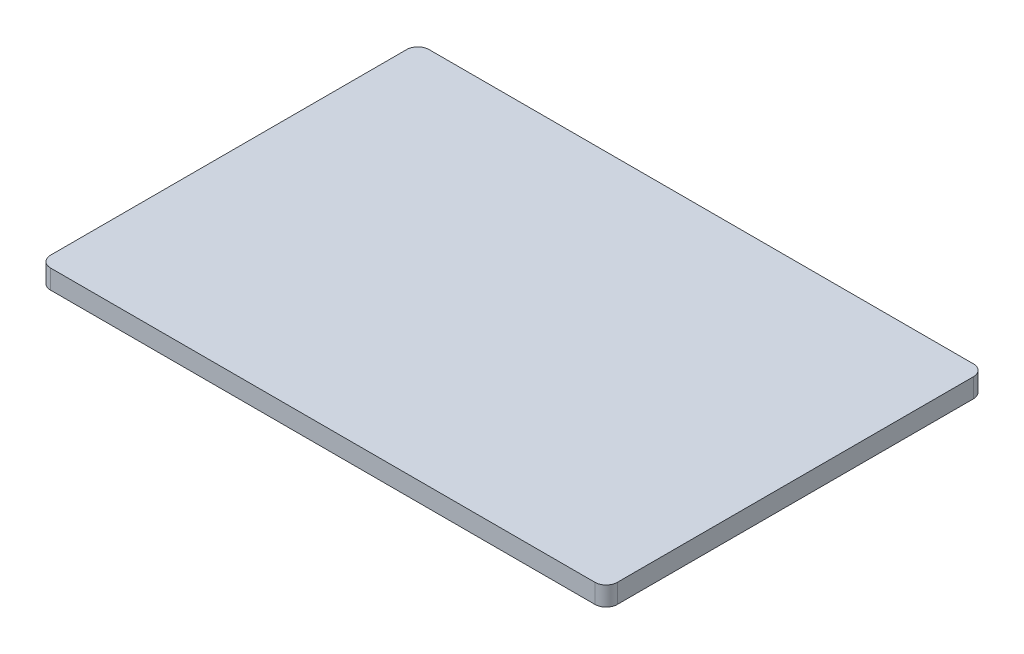
ISO-10303-21;
HEADER;
FILE_DESCRIPTION(('STEP AP214'),'2;1');
FILE_NAME('part.step','',(''),(''),'','','');
FILE_SCHEMA(('AUTOMOTIVE_DESIGN { 1 0 10303 214 1 1 1 1 }'));
ENDSEC;
DATA;
#1=APPLICATION_CONTEXT('core data for automotive mechanical design processes');
#2=APPLICATION_PROTOCOL_DEFINITION('international standard','automotive_design',2000,#1);
#3=PRODUCT_CONTEXT('',#1,'mechanical');
#4=PRODUCT('Part','Part','',(#3));
#5=PRODUCT_RELATED_PRODUCT_CATEGORY('part','',(#4));
#6=PRODUCT_DEFINITION_FORMATION('','',#4);
#7=PRODUCT_DEFINITION_CONTEXT('part definition',#1,'design');
#8=PRODUCT_DEFINITION('design','',#6,#7);
#9=PRODUCT_DEFINITION_SHAPE('','',#8);
#10=(LENGTH_UNIT() NAMED_UNIT(*) SI_UNIT(.MILLI.,.METRE.));
#11=(NAMED_UNIT(*) PLANE_ANGLE_UNIT() SI_UNIT($,.RADIAN.));
#12=(NAMED_UNIT(*) SI_UNIT($,.STERADIAN.) SOLID_ANGLE_UNIT());
#13=UNCERTAINTY_MEASURE_WITH_UNIT(LENGTH_MEASURE(1.E-05),#10,'distance_accuracy_value','');
#14=(GEOMETRIC_REPRESENTATION_CONTEXT(3) GLOBAL_UNCERTAINTY_ASSIGNED_CONTEXT((#13)) GLOBAL_UNIT_ASSIGNED_CONTEXT((#10,
#11,#12)) REPRESENTATION_CONTEXT('',''));
#15=CARTESIAN_POINT('',(0.,0.,0.));
#16=DIRECTION('',(0.,0.,1.));
#17=DIRECTION('',(1.,0.,0.));
#18=AXIS2_PLACEMENT_3D('',#15,#16,#17);
#19=CARTESIAN_POINT('',(0.,0.,0.));
#20=DIRECTION('',(0.,1.,0.));
#21=DIRECTION('',(0.,0.,1.));
#22=AXIS2_PLACEMENT_3D('',#19,#20,#21);
#23=PLANE('',#22);
#24=CARTESIAN_POINT('',(-42.5196,0.,-27.813));
#25=DIRECTION('',(0.,1.,0.));
#26=DIRECTION('',(0.,0.,1.));
#27=AXIS2_PLACEMENT_3D('',#24,#25,#26);
#28=CIRCLE('',#27,1.746);
#29=CARTESIAN_POINT('',(-42.5196,0.,-29.559));
#30=VERTEX_POINT('',#29);
#31=CARTESIAN_POINT('',(-44.2656,0.,-27.813));
#32=VERTEX_POINT('',#31);
#33=EDGE_CURVE('E116',#30,#32,#28,.T.);
#34=ORIENTED_EDGE('',*,*,#33,.F.);
#35=DIRECTION('',(-1.,0.,0.));
#36=VECTOR('',#35,1.);
#37=CARTESIAN_POINT('',(0.,0.,-29.559));
#38=LINE('',#37,#36);
#39=CARTESIAN_POINT('',(42.5196,0.,-29.559));
#40=VERTEX_POINT('',#39);
#41=EDGE_CURVE('E108',#40,#30,#38,.T.);
#42=ORIENTED_EDGE('',*,*,#41,.F.);
#43=CARTESIAN_POINT('',(42.5196,0.,-27.813));
#44=DIRECTION('',(0.,1.,0.));
#45=DIRECTION('',(0.,0.,1.));
#46=AXIS2_PLACEMENT_3D('',#43,#44,#45);
#47=CIRCLE('',#46,1.74600000000002);
#48=CARTESIAN_POINT('',(44.2656,0.,-27.813));
#49=VERTEX_POINT('',#48);
#50=EDGE_CURVE('E115',#49,#40,#47,.T.);
#51=ORIENTED_EDGE('',*,*,#50,.F.);
#52=DIRECTION('',(0.,0.,-1.));
#53=VECTOR('',#52,1.);
#54=CARTESIAN_POINT('',(44.2656,0.,0.));
#55=LINE('',#54,#53);
#56=CARTESIAN_POINT('',(44.2656,0.,27.813));
#57=VERTEX_POINT('',#56);
#58=EDGE_CURVE('E134',#57,#49,#55,.T.);
#59=ORIENTED_EDGE('',*,*,#58,.F.);
#60=CARTESIAN_POINT('',(42.5196,0.,27.813));
#61=DIRECTION('',(0.,1.,0.));
#62=DIRECTION('',(0.,0.,1.));
#63=AXIS2_PLACEMENT_3D('',#60,#61,#62);
#64=CIRCLE('',#63,1.746);
#65=CARTESIAN_POINT('',(42.5196,0.,29.559));
#66=VERTEX_POINT('',#65);
#67=EDGE_CURVE('E137',#66,#57,#64,.T.);
#68=ORIENTED_EDGE('',*,*,#67,.F.);
#69=DIRECTION('',(1.,0.,0.));
#70=VECTOR('',#69,1.);
#71=CARTESIAN_POINT('',(0.,0.,29.559));
#72=LINE('',#71,#70);
#73=CARTESIAN_POINT('',(-42.5196,0.,29.559));
#74=VERTEX_POINT('',#73);
#75=EDGE_CURVE('E140',#74,#66,#72,.T.);
#76=ORIENTED_EDGE('',*,*,#75,.F.);
#77=CARTESIAN_POINT('',(-42.5196,0.,27.813));
#78=DIRECTION('',(0.,1.,0.));
#79=DIRECTION('',(0.,0.,1.));
#80=AXIS2_PLACEMENT_3D('',#77,#78,#79);
#81=CIRCLE('',#80,1.74600000000001);
#82=CARTESIAN_POINT('',(-44.2656,0.,27.813));
#83=VERTEX_POINT('',#82);
#84=EDGE_CURVE('E143',#83,#74,#81,.T.);
#85=ORIENTED_EDGE('',*,*,#84,.F.);
#86=DIRECTION('',(0.,0.,1.));
#87=VECTOR('',#86,1.);
#88=CARTESIAN_POINT('',(-44.2656,0.,0.));
#89=LINE('',#88,#87);
#90=EDGE_CURVE('E121',#32,#83,#89,.T.);
#91=ORIENTED_EDGE('',*,*,#90,.F.);
#92=EDGE_LOOP('',(#34,#42,#51,#59,#68,#76,#85,#91));
#93=FACE_BOUND('',#92,.T.);
#94=ADVANCED_FACE('F42',(#93),#23,.F.);
#95=CARTESIAN_POINT('',(-42.5196,0.,-27.813));
#96=DIRECTION('',(0.,1.,0.));
#97=DIRECTION('',(0.,0.,1.));
#98=AXIS2_PLACEMENT_3D('',#95,#96,#97);
#99=CYLINDRICAL_SURFACE('',#98,1.746);
#100=CARTESIAN_POINT('',(-42.5196,2.9972,-27.813));
#101=DIRECTION('',(0.,1.,0.));
#102=DIRECTION('',(0.,0.,1.));
#103=AXIS2_PLACEMENT_3D('',#100,#101,#102);
#104=CIRCLE('',#103,1.746);
#105=CARTESIAN_POINT('',(-42.5196,2.9972,-29.559));
#106=VERTEX_POINT('',#105);
#107=CARTESIAN_POINT('',(-44.2656,2.9972,-27.813));
#108=VERTEX_POINT('',#107);
#109=EDGE_CURVE('E58',#106,#108,#104,.T.);
#110=ORIENTED_EDGE('',*,*,#109,.F.);
#111=DIRECTION('',(0.,1.,0.));
#112=VECTOR('',#111,1.);
#113=CARTESIAN_POINT('',(-42.5196,0.,-29.559));
#114=LINE('',#113,#112);
#115=EDGE_CURVE('E45',#30,#106,#114,.T.);
#116=ORIENTED_EDGE('',*,*,#115,.F.);
#117=ORIENTED_EDGE('',*,*,#33,.T.);
#118=DIRECTION('',(0.,1.,0.));
#119=VECTOR('',#118,1.);
#120=CARTESIAN_POINT('',(-44.2656,0.,-27.813));
#121=LINE('',#120,#119);
#122=EDGE_CURVE('E11',#32,#108,#121,.T.);
#123=ORIENTED_EDGE('',*,*,#122,.T.);
#124=EDGE_LOOP('',(#110,#116,#117,#123));
#125=FACE_BOUND('',#124,.T.);
#126=ADVANCED_FACE('F118',(#125),#99,.T.);
#127=CARTESIAN_POINT('',(-44.2656,0.,0.));
#128=DIRECTION('',(-1.,0.,0.));
#129=DIRECTION('',(0.,0.,1.));
#130=AXIS2_PLACEMENT_3D('',#127,#128,#129);
#131=PLANE('',#130);
#132=DIRECTION('',(0.,0.,1.));
#133=VECTOR('',#132,1.);
#134=CARTESIAN_POINT('',(-44.2656,2.9972,0.));
#135=LINE('',#134,#133);
#136=CARTESIAN_POINT('',(-44.2656,2.9972,27.813));
#137=VERTEX_POINT('',#136);
#138=EDGE_CURVE('E125',#108,#137,#135,.T.);
#139=ORIENTED_EDGE('',*,*,#138,.F.);
#140=ORIENTED_EDGE('',*,*,#122,.F.);
#141=ORIENTED_EDGE('',*,*,#90,.T.);
#142=DIRECTION('',(0.,1.,0.));
#143=VECTOR('',#142,1.);
#144=CARTESIAN_POINT('',(-44.2656,0.,27.813));
#145=LINE('',#144,#143);
#146=EDGE_CURVE('E51',#83,#137,#145,.T.);
#147=ORIENTED_EDGE('',*,*,#146,.T.);
#148=EDGE_LOOP('',(#139,#140,#141,#147));
#149=FACE_BOUND('',#148,.T.);
#150=ADVANCED_FACE('F212',(#149),#131,.T.);
#151=CARTESIAN_POINT('',(-42.5196,0.,27.813));
#152=DIRECTION('',(0.,1.,0.));
#153=DIRECTION('',(0.,0.,1.));
#154=AXIS2_PLACEMENT_3D('',#151,#152,#153);
#155=CYLINDRICAL_SURFACE('',#154,1.74600000000001);
#156=CARTESIAN_POINT('',(-42.5196,2.9972,27.813));
#157=DIRECTION('',(0.,1.,0.));
#158=DIRECTION('',(0.,0.,1.));
#159=AXIS2_PLACEMENT_3D('',#156,#157,#158);
#160=CIRCLE('',#159,1.74600000000001);
#161=CARTESIAN_POINT('',(-42.5196,2.9972,29.559));
#162=VERTEX_POINT('',#161);
#163=EDGE_CURVE('E129',#137,#162,#160,.T.);
#164=ORIENTED_EDGE('',*,*,#163,.F.);
#165=ORIENTED_EDGE('',*,*,#146,.F.);
#166=ORIENTED_EDGE('',*,*,#84,.T.);
#167=DIRECTION('',(0.,1.,0.));
#168=VECTOR('',#167,1.);
#169=CARTESIAN_POINT('',(-42.5196,0.,29.559));
#170=LINE('',#169,#168);
#171=EDGE_CURVE('E174',#74,#162,#170,.T.);
#172=ORIENTED_EDGE('',*,*,#171,.T.);
#173=EDGE_LOOP('',(#164,#165,#166,#172));
#174=FACE_BOUND('',#173,.T.);
#175=ADVANCED_FACE('F209',(#174),#155,.T.);
#176=CARTESIAN_POINT('',(0.,0.,29.559));
#177=DIRECTION('',(0.,0.,1.));
#178=DIRECTION('',(1.,0.,0.));
#179=AXIS2_PLACEMENT_3D('',#176,#177,#178);
#180=PLANE('',#179);
#181=DIRECTION('',(1.,0.,0.));
#182=VECTOR('',#181,1.);
#183=CARTESIAN_POINT('',(0.,2.9972,29.559));
#184=LINE('',#183,#182);
#185=CARTESIAN_POINT('',(42.5196,2.9972,29.559));
#186=VERTEX_POINT('',#185);
#187=EDGE_CURVE('E165',#162,#186,#184,.T.);
#188=ORIENTED_EDGE('',*,*,#187,.F.);
#189=ORIENTED_EDGE('',*,*,#171,.F.);
#190=ORIENTED_EDGE('',*,*,#75,.T.);
#191=DIRECTION('',(0.,1.,0.));
#192=VECTOR('',#191,1.);
#193=CARTESIAN_POINT('',(42.5196,0.,29.559));
#194=LINE('',#193,#192);
#195=EDGE_CURVE('E177',#66,#186,#194,.T.);
#196=ORIENTED_EDGE('',*,*,#195,.T.);
#197=EDGE_LOOP('',(#188,#189,#190,#196));
#198=FACE_BOUND('',#197,.T.);
#199=ADVANCED_FACE('F205',(#198),#180,.T.);
#200=CARTESIAN_POINT('',(42.5196,0.,27.813));
#201=DIRECTION('',(0.,1.,0.));
#202=DIRECTION('',(0.,0.,1.));
#203=AXIS2_PLACEMENT_3D('',#200,#201,#202);
#204=CYLINDRICAL_SURFACE('',#203,1.746);
#205=CARTESIAN_POINT('',(42.5196,2.9972,27.813));
#206=DIRECTION('',(0.,1.,0.));
#207=DIRECTION('',(0.,0.,1.));
#208=AXIS2_PLACEMENT_3D('',#205,#206,#207);
#209=CIRCLE('',#208,1.746);
#210=CARTESIAN_POINT('',(44.2656,2.9972,27.813));
#211=VERTEX_POINT('',#210);
#212=EDGE_CURVE('E161',#186,#211,#209,.T.);
#213=ORIENTED_EDGE('',*,*,#212,.F.);
#214=ORIENTED_EDGE('',*,*,#195,.F.);
#215=ORIENTED_EDGE('',*,*,#67,.T.);
#216=DIRECTION('',(0.,1.,0.));
#217=VECTOR('',#216,1.);
#218=CARTESIAN_POINT('',(44.2656,0.,27.813));
#219=LINE('',#218,#217);
#220=EDGE_CURVE('E180',#57,#211,#219,.T.);
#221=ORIENTED_EDGE('',*,*,#220,.T.);
#222=EDGE_LOOP('',(#213,#214,#215,#221));
#223=FACE_BOUND('',#222,.T.);
#224=ADVANCED_FACE('F202',(#223),#204,.T.);
#225=CARTESIAN_POINT('',(44.2656,0.,0.));
#226=DIRECTION('',(1.,0.,0.));
#227=DIRECTION('',(0.,0.,-1.));
#228=AXIS2_PLACEMENT_3D('',#225,#226,#227);
#229=PLANE('',#228);
#230=DIRECTION('',(0.,0.,-1.));
#231=VECTOR('',#230,1.);
#232=CARTESIAN_POINT('',(44.2656,2.9972,0.));
#233=LINE('',#232,#231);
#234=CARTESIAN_POINT('',(44.2656,2.9972,-27.813));
#235=VERTEX_POINT('',#234);
#236=EDGE_CURVE('E157',#211,#235,#233,.T.);
#237=ORIENTED_EDGE('',*,*,#236,.F.);
#238=ORIENTED_EDGE('',*,*,#220,.F.);
#239=ORIENTED_EDGE('',*,*,#58,.T.);
#240=DIRECTION('',(0.,1.,0.));
#241=VECTOR('',#240,1.);
#242=CARTESIAN_POINT('',(44.2656,0.,-27.813));
#243=LINE('',#242,#241);
#244=EDGE_CURVE('E183',#49,#235,#243,.T.);
#245=ORIENTED_EDGE('',*,*,#244,.T.);
#246=EDGE_LOOP('',(#237,#238,#239,#245));
#247=FACE_BOUND('',#246,.T.);
#248=ADVANCED_FACE('F196',(#247),#229,.T.);
#249=CARTESIAN_POINT('',(42.5196,0.,-27.813));
#250=DIRECTION('',(0.,1.,0.));
#251=DIRECTION('',(0.,0.,1.));
#252=AXIS2_PLACEMENT_3D('',#249,#250,#251);
#253=CYLINDRICAL_SURFACE('',#252,1.74600000000002);
#254=CARTESIAN_POINT('',(42.5196,2.9972,-27.813));
#255=DIRECTION('',(0.,1.,0.));
#256=DIRECTION('',(0.,0.,1.));
#257=AXIS2_PLACEMENT_3D('',#254,#255,#256);
#258=CIRCLE('',#257,1.74600000000002);
#259=CARTESIAN_POINT('',(42.5196,2.9972,-29.559));
#260=VERTEX_POINT('',#259);
#261=EDGE_CURVE('E153',#235,#260,#258,.T.);
#262=ORIENTED_EDGE('',*,*,#261,.F.);
#263=ORIENTED_EDGE('',*,*,#244,.F.);
#264=ORIENTED_EDGE('',*,*,#50,.T.);
#265=DIRECTION('',(0.,1.,0.));
#266=VECTOR('',#265,1.);
#267=CARTESIAN_POINT('',(42.5196,0.,-29.559));
#268=LINE('',#267,#266);
#269=EDGE_CURVE('E66',#40,#260,#268,.T.);
#270=ORIENTED_EDGE('',*,*,#269,.T.);
#271=EDGE_LOOP('',(#262,#263,#264,#270));
#272=FACE_BOUND('',#271,.T.);
#273=ADVANCED_FACE('F188',(#272),#253,.T.);
#274=CARTESIAN_POINT('',(0.,0.,-29.559));
#275=DIRECTION('',(0.,0.,-1.));
#276=DIRECTION('',(-1.,0.,0.));
#277=AXIS2_PLACEMENT_3D('',#274,#275,#276);
#278=PLANE('',#277);
#279=DIRECTION('',(-1.,0.,0.));
#280=VECTOR('',#279,1.);
#281=CARTESIAN_POINT('',(0.,2.9972,-29.559));
#282=LINE('',#281,#280);
#283=EDGE_CURVE('E150',#260,#106,#282,.T.);
#284=ORIENTED_EDGE('',*,*,#283,.F.);
#285=ORIENTED_EDGE('',*,*,#269,.F.);
#286=ORIENTED_EDGE('',*,*,#41,.T.);
#287=ORIENTED_EDGE('',*,*,#115,.T.);
#288=EDGE_LOOP('',(#284,#285,#286,#287));
#289=FACE_BOUND('',#288,.T.);
#290=ADVANCED_FACE('F109',(#289),#278,.T.);
#291=CARTESIAN_POINT('',(0.,2.9972,0.));
#292=DIRECTION('',(0.,1.,0.));
#293=DIRECTION('',(0.,0.,1.));
#294=AXIS2_PLACEMENT_3D('',#291,#292,#293);
#295=PLANE('',#294);
#296=ORIENTED_EDGE('',*,*,#283,.T.);
#297=ORIENTED_EDGE('',*,*,#109,.T.);
#298=ORIENTED_EDGE('',*,*,#138,.T.);
#299=ORIENTED_EDGE('',*,*,#163,.T.);
#300=ORIENTED_EDGE('',*,*,#187,.T.);
#301=ORIENTED_EDGE('',*,*,#212,.T.);
#302=ORIENTED_EDGE('',*,*,#236,.T.);
#303=ORIENTED_EDGE('',*,*,#261,.T.);
#304=EDGE_LOOP('',(#296,#297,#298,#299,#300,#301,#302,#303));
#305=FACE_BOUND('',#304,.T.);
#306=ADVANCED_FACE('F191',(#305),#295,.T.);
#307=CLOSED_SHELL('',(#94,#126,#150,#175,#199,#224,#248,#273,#290,#306));
#308=MANIFOLD_SOLID_BREP('B2',#307);
#309=ADVANCED_BREP_SHAPE_REPRESENTATION('',(#18,#308),#14);
#310=SHAPE_DEFINITION_REPRESENTATION(#9,#309);
ENDSEC;
END-ISO-10303-21;
